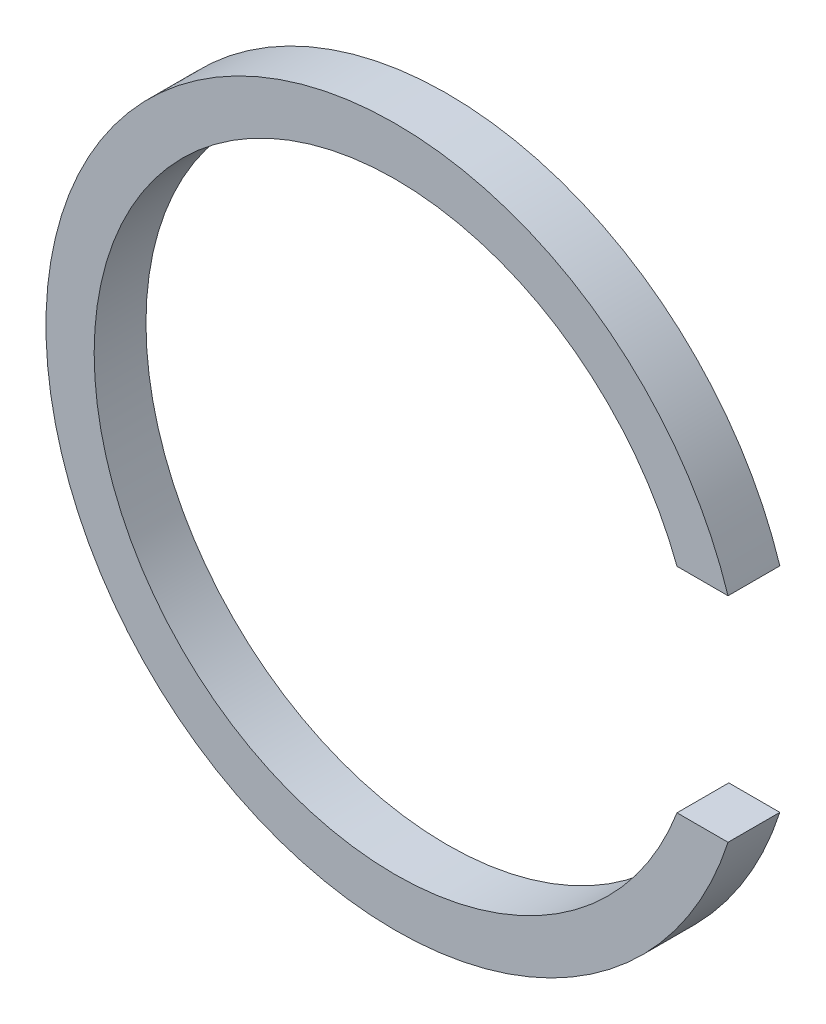
ISO-10303-21;
HEADER;
FILE_DESCRIPTION(('STEP AP214'),'2;1');
FILE_NAME('part.step','',(''),(''),'','','');
FILE_SCHEMA(('AUTOMOTIVE_DESIGN { 1 0 10303 214 1 1 1 1 }'));
ENDSEC;
DATA;
#1=APPLICATION_CONTEXT('core data for automotive mechanical design processes');
#2=APPLICATION_PROTOCOL_DEFINITION('international standard','automotive_design',2000,#1);
#3=PRODUCT_CONTEXT('',#1,'mechanical');
#4=PRODUCT('Part','Part','',(#3));
#5=PRODUCT_RELATED_PRODUCT_CATEGORY('part','',(#4));
#6=PRODUCT_DEFINITION_FORMATION('','',#4);
#7=PRODUCT_DEFINITION_CONTEXT('part definition',#1,'design');
#8=PRODUCT_DEFINITION('design','',#6,#7);
#9=PRODUCT_DEFINITION_SHAPE('','',#8);
#10=(LENGTH_UNIT() NAMED_UNIT(*) SI_UNIT(.MILLI.,.METRE.));
#11=(NAMED_UNIT(*) PLANE_ANGLE_UNIT() SI_UNIT($,.RADIAN.));
#12=(NAMED_UNIT(*) SI_UNIT($,.STERADIAN.) SOLID_ANGLE_UNIT());
#13=UNCERTAINTY_MEASURE_WITH_UNIT(LENGTH_MEASURE(1.E-05),#10,'distance_accuracy_value','');
#14=(GEOMETRIC_REPRESENTATION_CONTEXT(3) GLOBAL_UNCERTAINTY_ASSIGNED_CONTEXT((#13)) GLOBAL_UNIT_ASSIGNED_CONTEXT((#10,
#11,#12)) REPRESENTATION_CONTEXT('',''));
#15=CARTESIAN_POINT('',(0.,0.,0.));
#16=DIRECTION('',(0.,0.,1.));
#17=DIRECTION('',(1.,0.,0.));
#18=AXIS2_PLACEMENT_3D('',#15,#16,#17);
#19=CARTESIAN_POINT('',(70.133938824224,26.575,12.9));
#20=DIRECTION('',(0.,1.,0.));
#21=DIRECTION('',(0.,0.,1.));
#22=AXIS2_PLACEMENT_3D('',#19,#20,#21);
#23=PLANE('',#22);
#24=DIRECTION('',(1.,0.,0.));
#25=VECTOR('',#24,1.);
#26=CARTESIAN_POINT('',(70.133938824224,26.575,0.));
#27=LINE('',#26,#25);
#28=CARTESIAN_POINT('',(70.1339388242241,26.575,0.));
#29=VERTEX_POINT('',#28);
#30=CARTESIAN_POINT('',(82.8418334840556,26.575,0.));
#31=VERTEX_POINT('',#30);
#32=EDGE_CURVE('E97',#29,#31,#27,.T.);
#33=ORIENTED_EDGE('',*,*,#32,.T.);
#34=DIRECTION('',(0.,0.,-1.));
#35=VECTOR('',#34,1.);
#36=CARTESIAN_POINT('',(82.8418334840556,26.575,12.9));
#37=LINE('',#36,#35);
#38=CARTESIAN_POINT('',(82.8418334840556,26.575,12.9));
#39=VERTEX_POINT('',#38);
#40=EDGE_CURVE('E11',#39,#31,#37,.T.);
#41=ORIENTED_EDGE('',*,*,#40,.F.);
#42=DIRECTION('',(1.,0.,0.));
#43=VECTOR('',#42,1.);
#44=CARTESIAN_POINT('',(70.133938824224,26.575,12.9));
#45=LINE('',#44,#43);
#46=CARTESIAN_POINT('',(70.1339388242241,26.575,12.9));
#47=VERTEX_POINT('',#46);
#48=EDGE_CURVE('E83',#47,#39,#45,.T.);
#49=ORIENTED_EDGE('',*,*,#48,.F.);
#50=DIRECTION('',(0.,0.,-1.));
#51=VECTOR('',#50,1.);
#52=CARTESIAN_POINT('',(70.1339388242241,26.575,12.9));
#53=LINE('',#52,#51);
#54=EDGE_CURVE('E50',#47,#29,#53,.T.);
#55=ORIENTED_EDGE('',*,*,#54,.T.);
#56=EDGE_LOOP('',(#33,#41,#49,#55));
#57=FACE_BOUND('',#56,.T.);
#58=ADVANCED_FACE('F34',(#57),#23,.F.);
#59=CARTESIAN_POINT('',(0.,0.,12.9));
#60=DIRECTION('',(0.,0.,-1.));
#61=DIRECTION('',(-1.,0.,0.));
#62=AXIS2_PLACEMENT_3D('',#59,#60,#61);
#63=CYLINDRICAL_SURFACE('',#62,87.);
#64=CARTESIAN_POINT('',(0.,0.,0.));
#65=DIRECTION('',(0.,0.,1.));
#66=DIRECTION('',(1.,0.,0.));
#67=AXIS2_PLACEMENT_3D('',#64,#65,#66);
#68=CIRCLE('',#67,87.);
#69=CARTESIAN_POINT('',(82.8418334840556,-26.575,0.));
#70=VERTEX_POINT('',#69);
#71=EDGE_CURVE('E88',#31,#70,#68,.T.);
#72=ORIENTED_EDGE('',*,*,#71,.T.);
#73=DIRECTION('',(0.,0.,-1.));
#74=VECTOR('',#73,1.);
#75=CARTESIAN_POINT('',(82.8418334840556,-26.575,12.9));
#76=LINE('',#75,#74);
#77=CARTESIAN_POINT('',(82.8418334840556,-26.575,12.9));
#78=VERTEX_POINT('',#77);
#79=EDGE_CURVE('E42',#78,#70,#76,.T.);
#80=ORIENTED_EDGE('',*,*,#79,.F.);
#81=CARTESIAN_POINT('',(0.,0.,12.9));
#82=DIRECTION('',(0.,0.,1.));
#83=DIRECTION('',(1.,0.,0.));
#84=AXIS2_PLACEMENT_3D('',#81,#82,#83);
#85=CIRCLE('',#84,87.);
#86=EDGE_CURVE('E75',#39,#78,#85,.T.);
#87=ORIENTED_EDGE('',*,*,#86,.F.);
#88=ORIENTED_EDGE('',*,*,#40,.T.);
#89=EDGE_LOOP('',(#72,#80,#87,#88));
#90=FACE_BOUND('',#89,.T.);
#91=ADVANCED_FACE('F87',(#90),#63,.T.);
#92=CARTESIAN_POINT('',(70.133938824224,-26.575,12.9));
#93=DIRECTION('',(0.,1.,0.));
#94=DIRECTION('',(0.,0.,1.));
#95=AXIS2_PLACEMENT_3D('',#92,#93,#94);
#96=PLANE('',#95);
#97=DIRECTION('',(1.,0.,0.));
#98=VECTOR('',#97,1.);
#99=CARTESIAN_POINT('',(70.133938824224,-26.575,0.));
#100=LINE('',#99,#98);
#101=CARTESIAN_POINT('',(70.133938824224,-26.575,0.));
#102=VERTEX_POINT('',#101);
#103=EDGE_CURVE('E100',#102,#70,#100,.T.);
#104=ORIENTED_EDGE('',*,*,#103,.F.);
#105=DIRECTION('',(0.,0.,-1.));
#106=VECTOR('',#105,1.);
#107=CARTESIAN_POINT('',(70.133938824224,-26.575,12.9));
#108=LINE('',#107,#106);
#109=CARTESIAN_POINT('',(70.133938824224,-26.575,12.9));
#110=VERTEX_POINT('',#109);
#111=EDGE_CURVE('E64',#110,#102,#108,.T.);
#112=ORIENTED_EDGE('',*,*,#111,.F.);
#113=DIRECTION('',(1.,0.,0.));
#114=VECTOR('',#113,1.);
#115=CARTESIAN_POINT('',(70.133938824224,-26.575,12.9));
#116=LINE('',#115,#114);
#117=EDGE_CURVE('E82',#110,#78,#116,.T.);
#118=ORIENTED_EDGE('',*,*,#117,.T.);
#119=ORIENTED_EDGE('',*,*,#79,.T.);
#120=EDGE_LOOP('',(#104,#112,#118,#119));
#121=FACE_BOUND('',#120,.T.);
#122=ADVANCED_FACE('F91',(#121),#96,.T.);
#123=CARTESIAN_POINT('',(0.,0.,12.9));
#124=DIRECTION('',(0.,0.,-1.));
#125=DIRECTION('',(-1.,0.,0.));
#126=AXIS2_PLACEMENT_3D('',#123,#124,#125);
#127=CYLINDRICAL_SURFACE('',#126,75.);
#128=CARTESIAN_POINT('',(0.,0.,0.));
#129=DIRECTION('',(0.,0.,1.));
#130=DIRECTION('',(1.,0.,0.));
#131=AXIS2_PLACEMENT_3D('',#128,#129,#130);
#132=CIRCLE('',#131,75.);
#133=EDGE_CURVE('E102',#29,#102,#132,.T.);
#134=ORIENTED_EDGE('',*,*,#133,.F.);
#135=ORIENTED_EDGE('',*,*,#54,.F.);
#136=CARTESIAN_POINT('',(0.,0.,12.9));
#137=DIRECTION('',(0.,0.,1.));
#138=DIRECTION('',(1.,0.,0.));
#139=AXIS2_PLACEMENT_3D('',#136,#137,#138);
#140=CIRCLE('',#139,75.);
#141=EDGE_CURVE('E92',#47,#110,#140,.T.);
#142=ORIENTED_EDGE('',*,*,#141,.T.);
#143=ORIENTED_EDGE('',*,*,#111,.T.);
#144=EDGE_LOOP('',(#134,#135,#142,#143));
#145=FACE_BOUND('',#144,.T.);
#146=ADVANCED_FACE('F108',(#145),#127,.F.);
#147=CARTESIAN_POINT('',(0.,0.,12.9));
#148=DIRECTION('',(0.,0.,1.));
#149=DIRECTION('',(1.,0.,0.));
#150=AXIS2_PLACEMENT_3D('',#147,#148,#149);
#151=PLANE('',#150);
#152=ORIENTED_EDGE('',*,*,#48,.T.);
#153=ORIENTED_EDGE('',*,*,#86,.T.);
#154=ORIENTED_EDGE('',*,*,#117,.F.);
#155=ORIENTED_EDGE('',*,*,#141,.F.);
#156=EDGE_LOOP('',(#152,#153,#154,#155));
#157=FACE_BOUND('',#156,.T.);
#158=ADVANCED_FACE('F79',(#157),#151,.T.);
#159=CARTESIAN_POINT('',(0.,0.,0.));
#160=DIRECTION('',(0.,0.,1.));
#161=DIRECTION('',(1.,0.,0.));
#162=AXIS2_PLACEMENT_3D('',#159,#160,#161);
#163=PLANE('',#162);
#164=ORIENTED_EDGE('',*,*,#32,.F.);
#165=ORIENTED_EDGE('',*,*,#133,.T.);
#166=ORIENTED_EDGE('',*,*,#103,.T.);
#167=ORIENTED_EDGE('',*,*,#71,.F.);
#168=EDGE_LOOP('',(#164,#165,#166,#167));
#169=FACE_BOUND('',#168,.T.);
#170=ADVANCED_FACE('F107',(#169),#163,.F.);
#171=CLOSED_SHELL('',(#58,#91,#122,#146,#158,#170));
#172=MANIFOLD_SOLID_BREP('B2',#171);
#173=ADVANCED_BREP_SHAPE_REPRESENTATION('',(#18,#172),#14);
#174=SHAPE_DEFINITION_REPRESENTATION(#9,#173);
ENDSEC;
END-ISO-10303-21;
